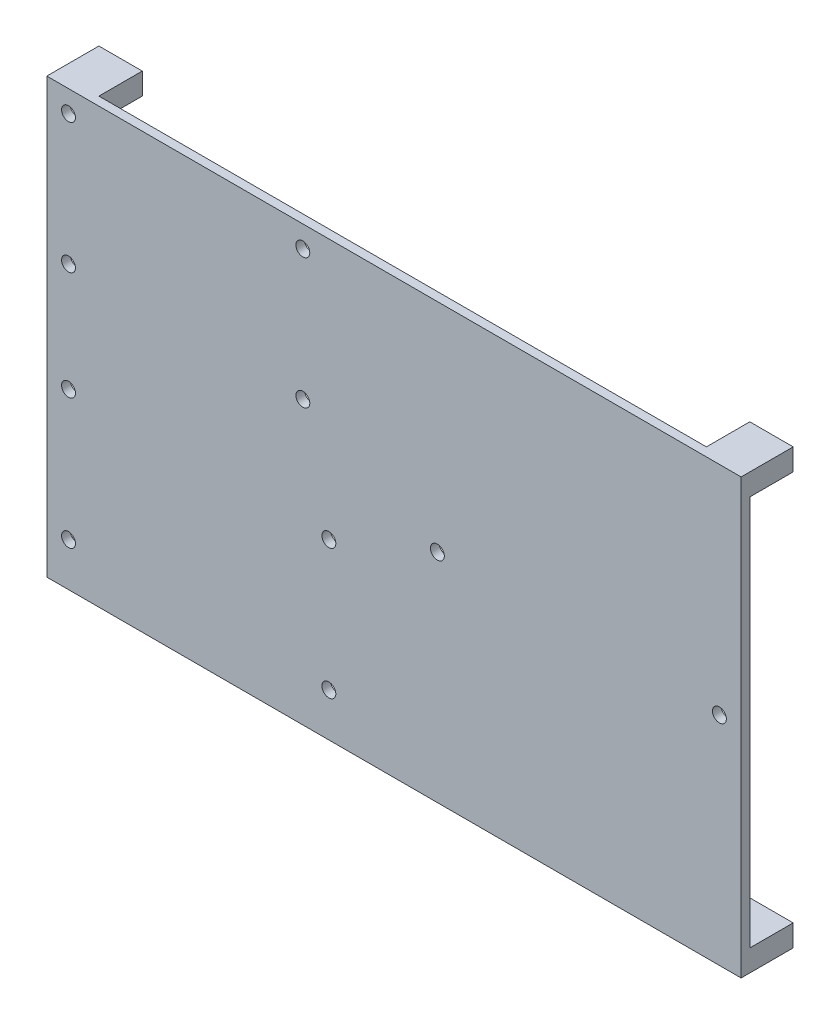
ISO-10303-21;
HEADER;
FILE_DESCRIPTION(('STEP AP214'),'2;1');
FILE_NAME('part.step','',(''),(''),'','','');
FILE_SCHEMA(('AUTOMOTIVE_DESIGN { 1 0 10303 214 1 1 1 1 }'));
ENDSEC;
DATA;
#1=APPLICATION_CONTEXT('core data for automotive mechanical design processes');
#2=APPLICATION_PROTOCOL_DEFINITION('international standard','automotive_design',2000,#1);
#3=PRODUCT_CONTEXT('',#1,'mechanical');
#4=PRODUCT('Part','Part','',(#3));
#5=PRODUCT_RELATED_PRODUCT_CATEGORY('part','',(#4));
#6=PRODUCT_DEFINITION_FORMATION('','',#4);
#7=PRODUCT_DEFINITION_CONTEXT('part definition',#1,'design');
#8=PRODUCT_DEFINITION('design','',#6,#7);
#9=PRODUCT_DEFINITION_SHAPE('','',#8);
#10=(LENGTH_UNIT() NAMED_UNIT(*) SI_UNIT(.MILLI.,.METRE.));
#11=(NAMED_UNIT(*) PLANE_ANGLE_UNIT() SI_UNIT($,.RADIAN.));
#12=(NAMED_UNIT(*) SI_UNIT($,.STERADIAN.) SOLID_ANGLE_UNIT());
#13=UNCERTAINTY_MEASURE_WITH_UNIT(LENGTH_MEASURE(1.E-05),#10,'distance_accuracy_value','');
#14=(GEOMETRIC_REPRESENTATION_CONTEXT(3) GLOBAL_UNCERTAINTY_ASSIGNED_CONTEXT((#13)) GLOBAL_UNIT_ASSIGNED_CONTEXT((#10,
#11,#12)) REPRESENTATION_CONTEXT('',''));
#15=CARTESIAN_POINT('',(0.,0.,0.));
#16=DIRECTION('',(0.,0.,1.));
#17=DIRECTION('',(1.,0.,0.));
#18=AXIS2_PLACEMENT_3D('',#15,#16,#17);
#19=CARTESIAN_POINT('',(0.,0.,2.));
#20=DIRECTION('',(0.,0.,1.));
#21=DIRECTION('',(1.,0.,0.));
#22=AXIS2_PLACEMENT_3D('',#19,#20,#21);
#23=PLANE('',#22);
#24=CARTESIAN_POINT('',(-1.53384445171995,11.8620860109576,2.));
#25=DIRECTION('',(0.,0.,1.));
#26=DIRECTION('',(1.,0.,0.));
#27=AXIS2_PLACEMENT_3D('',#24,#25,#26);
#28=CIRCLE('',#27,1.6);
#29=CARTESIAN_POINT('',(0.0661555482800562,11.8620860109576,2.));
#30=VERTEX_POINT('',#29);
#31=EDGE_CURVE('E291',#30,#30,#28,.T.);
#32=ORIENTED_EDGE('',*,*,#31,.F.);
#33=EDGE_LOOP('',(#32));
#34=FACE_BOUND('',#33,.T.);
#35=CARTESIAN_POINT('',(-55.53384445172,41.8620860109576,2.));
#36=DIRECTION('',(0.,0.,1.));
#37=DIRECTION('',(1.,0.,0.));
#38=AXIS2_PLACEMENT_3D('',#35,#36,#37);
#39=CIRCLE('',#38,1.6);
#40=CARTESIAN_POINT('',(-53.93384445172,41.8620860109576,2.));
#41=VERTEX_POINT('',#40);
#42=EDGE_CURVE('E307',#41,#41,#39,.T.);
#43=ORIENTED_EDGE('',*,*,#42,.F.);
#44=EDGE_LOOP('',(#43));
#45=FACE_BOUND('',#44,.T.);
#46=CARTESIAN_POINT('',(4.46615554828006,-13.1379139890424,2.));
#47=DIRECTION('',(0.,0.,1.));
#48=DIRECTION('',(1.,0.,0.));
#49=AXIS2_PLACEMENT_3D('',#46,#47,#48);
#50=CIRCLE('',#49,1.6);
#51=CARTESIAN_POINT('',(6.06615554828007,-13.1379139890424,2.));
#52=VERTEX_POINT('',#51);
#53=EDGE_CURVE('E323',#52,#52,#50,.T.);
#54=ORIENTED_EDGE('',*,*,#53,.F.);
#55=EDGE_LOOP('',(#54));
#56=FACE_BOUND('',#55,.T.);
#57=CARTESIAN_POINT('',(-55.5338444517199,-43.1379139890424,2.));
#58=DIRECTION('',(0.,0.,1.));
#59=DIRECTION('',(1.,0.,0.));
#60=AXIS2_PLACEMENT_3D('',#57,#58,#59);
#61=CIRCLE('',#60,1.6);
#62=CARTESIAN_POINT('',(-53.9338444517199,-43.1379139890424,2.));
#63=VERTEX_POINT('',#62);
#64=EDGE_CURVE('E339',#63,#63,#61,.T.);
#65=ORIENTED_EDGE('',*,*,#64,.F.);
#66=EDGE_LOOP('',(#65));
#67=FACE_BOUND('',#66,.T.);
#68=CARTESIAN_POINT('',(94.4661555482801,-3.1379139890424,2.));
#69=DIRECTION('',(0.,0.,1.));
#70=DIRECTION('',(1.,0.,0.));
#71=AXIS2_PLACEMENT_3D('',#68,#69,#70);
#72=CIRCLE('',#71,1.60000000000001);
#73=CARTESIAN_POINT('',(96.0661555482801,-3.1379139890424,2.));
#74=VERTEX_POINT('',#73);
#75=EDGE_CURVE('E355',#74,#74,#72,.T.);
#76=ORIENTED_EDGE('',*,*,#75,.F.);
#77=EDGE_LOOP('',(#76));
#78=FACE_BOUND('',#77,.T.);
#79=DIRECTION('',(0.,-1.,0.));
#80=VECTOR('',#79,1.);
#81=CARTESIAN_POINT('',(-60.5338444517199,46.8620860109576,2.));
#82=LINE('',#81,#80);
#83=CARTESIAN_POINT('',(-60.5338444517199,46.8620860109576,2.));
#84=VERTEX_POINT('',#83);
#85=CARTESIAN_POINT('',(-60.5338444517199,-53.1379139890424,2.));
#86=VERTEX_POINT('',#85);
#87=EDGE_CURVE('E196',#84,#86,#82,.T.);
#88=ORIENTED_EDGE('',*,*,#87,.T.);
#89=DIRECTION('',(1.,0.,0.));
#90=VECTOR('',#89,1.);
#91=CARTESIAN_POINT('',(-60.5338444517199,-53.1379139890424,2.));
#92=LINE('',#91,#90);
#93=CARTESIAN_POINT('',(99.4661555482801,-53.1379139890424,2.));
#94=VERTEX_POINT('',#93);
#95=EDGE_CURVE('E202',#86,#94,#92,.T.);
#96=ORIENTED_EDGE('',*,*,#95,.T.);
#97=DIRECTION('',(0.,1.,0.));
#98=VECTOR('',#97,1.);
#99=CARTESIAN_POINT('',(99.4661555482801,46.8620860109576,2.));
#100=LINE('',#99,#98);
#101=CARTESIAN_POINT('',(99.4661555482801,46.8620860109576,2.));
#102=VERTEX_POINT('',#101);
#103=EDGE_CURVE('E365',#94,#102,#100,.T.);
#104=ORIENTED_EDGE('',*,*,#103,.T.);
#105=DIRECTION('',(-1.,0.,0.));
#106=VECTOR('',#105,1.);
#107=CARTESIAN_POINT('',(-60.5338444517199,46.8620860109576,2.));
#108=LINE('',#107,#106);
#109=EDGE_CURVE('E213',#102,#84,#108,.T.);
#110=ORIENTED_EDGE('',*,*,#109,.T.);
#111=EDGE_LOOP('',(#88,#96,#104,#110));
#112=FACE_BOUND('',#111,.T.);
#113=CARTESIAN_POINT('',(29.4661555482801,-3.1379139890424,2.));
#114=DIRECTION('',(0.,0.,1.));
#115=DIRECTION('',(1.,0.,0.));
#116=AXIS2_PLACEMENT_3D('',#113,#114,#115);
#117=CIRCLE('',#116,1.6);
#118=CARTESIAN_POINT('',(31.0661555482801,-3.1379139890424,2.));
#119=VERTEX_POINT('',#118);
#120=EDGE_CURVE('E347',#119,#119,#117,.T.);
#121=ORIENTED_EDGE('',*,*,#120,.F.);
#122=EDGE_LOOP('',(#121));
#123=FACE_BOUND('',#122,.T.);
#124=CARTESIAN_POINT('',(-55.5338444517199,-13.1379139890424,2.));
#125=DIRECTION('',(0.,0.,1.));
#126=DIRECTION('',(1.,0.,0.));
#127=AXIS2_PLACEMENT_3D('',#124,#125,#126);
#128=CIRCLE('',#127,1.6);
#129=CARTESIAN_POINT('',(-53.9338444517199,-13.1379139890424,2.));
#130=VERTEX_POINT('',#129);
#131=EDGE_CURVE('E331',#130,#130,#128,.T.);
#132=ORIENTED_EDGE('',*,*,#131,.F.);
#133=EDGE_LOOP('',(#132));
#134=FACE_BOUND('',#133,.T.);
#135=CARTESIAN_POINT('',(4.46615554828008,-43.1379139890424,2.));
#136=DIRECTION('',(0.,0.,1.));
#137=DIRECTION('',(1.,0.,0.));
#138=AXIS2_PLACEMENT_3D('',#135,#136,#137);
#139=CIRCLE('',#138,1.6);
#140=CARTESIAN_POINT('',(6.06615554828007,-43.1379139890424,2.));
#141=VERTEX_POINT('',#140);
#142=EDGE_CURVE('E315',#141,#141,#139,.T.);
#143=ORIENTED_EDGE('',*,*,#142,.F.);
#144=EDGE_LOOP('',(#143));
#145=FACE_BOUND('',#144,.T.);
#146=CARTESIAN_POINT('',(-55.53384445172,11.8620860109576,2.));
#147=DIRECTION('',(0.,0.,1.));
#148=DIRECTION('',(1.,0.,0.));
#149=AXIS2_PLACEMENT_3D('',#146,#147,#148);
#150=CIRCLE('',#149,1.6);
#151=CARTESIAN_POINT('',(-53.93384445172,11.8620860109576,2.));
#152=VERTEX_POINT('',#151);
#153=EDGE_CURVE('E299',#152,#152,#150,.T.);
#154=ORIENTED_EDGE('',*,*,#153,.F.);
#155=EDGE_LOOP('',(#154));
#156=FACE_BOUND('',#155,.T.);
#157=CARTESIAN_POINT('',(-1.53384445171996,41.8620860109576,2.));
#158=DIRECTION('',(0.,0.,1.));
#159=DIRECTION('',(1.,0.,0.));
#160=AXIS2_PLACEMENT_3D('',#157,#158,#159);
#161=CIRCLE('',#160,1.6);
#162=CARTESIAN_POINT('',(0.0661555482800401,41.8620860109576,2.));
#163=VERTEX_POINT('',#162);
#164=EDGE_CURVE('E283',#163,#163,#161,.T.);
#165=ORIENTED_EDGE('',*,*,#164,.F.);
#166=EDGE_LOOP('',(#165));
#167=FACE_BOUND('',#166,.T.);
#168=ADVANCED_FACE('F45',(#34,#45,#56,#67,#78,#112,#123,#134,#145,#156,#167),#23,.T.);
#169=CARTESIAN_POINT('',(0.,0.,0.));
#170=DIRECTION('',(0.,0.,1.));
#171=DIRECTION('',(1.,0.,0.));
#172=AXIS2_PLACEMENT_3D('',#169,#170,#171);
#173=PLANE('',#172);
#174=CARTESIAN_POINT('',(94.4661555482801,-3.1379139890424,0.));
#175=DIRECTION('',(0.,0.,1.));
#176=DIRECTION('',(1.,0.,0.));
#177=AXIS2_PLACEMENT_3D('',#174,#175,#176);
#178=CIRCLE('',#177,1.60000000000001);
#179=CARTESIAN_POINT('',(96.0661555482801,-3.1379139890424,0.));
#180=VERTEX_POINT('',#179);
#181=EDGE_CURVE('E351',#180,#180,#178,.T.);
#182=ORIENTED_EDGE('',*,*,#181,.T.);
#183=EDGE_LOOP('',(#182));
#184=FACE_BOUND('',#183,.T.);
#185=CARTESIAN_POINT('',(29.4661555482801,-3.1379139890424,0.));
#186=DIRECTION('',(0.,0.,1.));
#187=DIRECTION('',(1.,0.,0.));
#188=AXIS2_PLACEMENT_3D('',#185,#186,#187);
#189=CIRCLE('',#188,1.6);
#190=CARTESIAN_POINT('',(31.0661555482801,-3.1379139890424,0.));
#191=VERTEX_POINT('',#190);
#192=EDGE_CURVE('E343',#191,#191,#189,.T.);
#193=ORIENTED_EDGE('',*,*,#192,.T.);
#194=EDGE_LOOP('',(#193));
#195=FACE_BOUND('',#194,.T.);
#196=CARTESIAN_POINT('',(-55.5338444517199,-43.1379139890424,0.));
#197=DIRECTION('',(0.,0.,1.));
#198=DIRECTION('',(1.,0.,0.));
#199=AXIS2_PLACEMENT_3D('',#196,#197,#198);
#200=CIRCLE('',#199,1.6);
#201=CARTESIAN_POINT('',(-53.9338444517199,-43.1379139890424,0.));
#202=VERTEX_POINT('',#201);
#203=EDGE_CURVE('E335',#202,#202,#200,.T.);
#204=ORIENTED_EDGE('',*,*,#203,.T.);
#205=EDGE_LOOP('',(#204));
#206=FACE_BOUND('',#205,.T.);
#207=CARTESIAN_POINT('',(-55.5338444517199,-13.1379139890424,0.));
#208=DIRECTION('',(0.,0.,1.));
#209=DIRECTION('',(1.,0.,0.));
#210=AXIS2_PLACEMENT_3D('',#207,#208,#209);
#211=CIRCLE('',#210,1.6);
#212=CARTESIAN_POINT('',(-53.9338444517199,-13.1379139890424,0.));
#213=VERTEX_POINT('',#212);
#214=EDGE_CURVE('E327',#213,#213,#211,.T.);
#215=ORIENTED_EDGE('',*,*,#214,.T.);
#216=EDGE_LOOP('',(#215));
#217=FACE_BOUND('',#216,.T.);
#218=CARTESIAN_POINT('',(4.46615554828006,-13.1379139890424,0.));
#219=DIRECTION('',(0.,0.,1.));
#220=DIRECTION('',(1.,0.,0.));
#221=AXIS2_PLACEMENT_3D('',#218,#219,#220);
#222=CIRCLE('',#221,1.6);
#223=CARTESIAN_POINT('',(6.06615554828007,-13.1379139890424,0.));
#224=VERTEX_POINT('',#223);
#225=EDGE_CURVE('E319',#224,#224,#222,.T.);
#226=ORIENTED_EDGE('',*,*,#225,.T.);
#227=EDGE_LOOP('',(#226));
#228=FACE_BOUND('',#227,.T.);
#229=CARTESIAN_POINT('',(4.46615554828008,-43.1379139890424,0.));
#230=DIRECTION('',(0.,0.,1.));
#231=DIRECTION('',(1.,0.,0.));
#232=AXIS2_PLACEMENT_3D('',#229,#230,#231);
#233=CIRCLE('',#232,1.6);
#234=CARTESIAN_POINT('',(6.06615554828007,-43.1379139890424,0.));
#235=VERTEX_POINT('',#234);
#236=EDGE_CURVE('E311',#235,#235,#233,.T.);
#237=ORIENTED_EDGE('',*,*,#236,.T.);
#238=EDGE_LOOP('',(#237));
#239=FACE_BOUND('',#238,.T.);
#240=DIRECTION('',(0.,1.,0.));
#241=VECTOR('',#240,1.);
#242=CARTESIAN_POINT('',(-50.5338444517199,0.,0.));
#243=LINE('',#242,#241);
#244=CARTESIAN_POINT('',(-50.5338444517199,-53.1379139890424,0.));
#245=VERTEX_POINT('',#244);
#246=CARTESIAN_POINT('',(-50.5338444517199,-48.1379139890424,0.));
#247=VERTEX_POINT('',#246);
#248=EDGE_CURVE('E249',#245,#247,#243,.T.);
#249=ORIENTED_EDGE('',*,*,#248,.T.);
#250=DIRECTION('',(-1.,0.,0.));
#251=VECTOR('',#250,1.);
#252=CARTESIAN_POINT('',(0.,-48.1379139890424,0.));
#253=LINE('',#252,#251);
#254=CARTESIAN_POINT('',(-60.5338444517199,-48.1379139890424,0.));
#255=VERTEX_POINT('',#254);
#256=EDGE_CURVE('E64',#247,#255,#253,.T.);
#257=ORIENTED_EDGE('',*,*,#256,.T.);
#258=DIRECTION('',(0.,-1.,0.));
#259=VECTOR('',#258,1.);
#260=CARTESIAN_POINT('',(-60.5338444517199,46.8620860109576,0.));
#261=LINE('',#260,#259);
#262=CARTESIAN_POINT('',(-60.5338444517199,41.8620860109576,0.));
#263=VERTEX_POINT('',#262);
#264=EDGE_CURVE('E359',#263,#255,#261,.T.);
#265=ORIENTED_EDGE('',*,*,#264,.F.);
#266=DIRECTION('',(1.,0.,0.));
#267=VECTOR('',#266,1.);
#268=CARTESIAN_POINT('',(0.,41.8620860109576,0.));
#269=LINE('',#268,#267);
#270=CARTESIAN_POINT('',(-57.13384445172,41.8620860109576,0.));
#271=VERTEX_POINT('',#270);
#272=EDGE_CURVE('E56',#263,#271,#269,.T.);
#273=ORIENTED_EDGE('',*,*,#272,.T.);
#274=CARTESIAN_POINT('',(-55.53384445172,41.8620860109576,0.));
#275=DIRECTION('',(0.,0.,1.));
#276=DIRECTION('',(1.,0.,0.));
#277=AXIS2_PLACEMENT_3D('',#274,#275,#276);
#278=CIRCLE('',#277,1.6);
#279=CARTESIAN_POINT('',(-53.93384445172,41.8620860109576,0.));
#280=VERTEX_POINT('',#279);
#281=EDGE_CURVE('E303',#271,#280,#278,.T.);
#282=ORIENTED_EDGE('',*,*,#281,.T.);
#283=CARTESIAN_POINT('',(-50.5338444517199,41.8620860109576,0.));
#284=VERTEX_POINT('',#283);
#285=EDGE_CURVE('E11',#280,#284,#269,.T.);
#286=ORIENTED_EDGE('',*,*,#285,.T.);
#287=DIRECTION('',(0.,1.,0.));
#288=VECTOR('',#287,1.);
#289=CARTESIAN_POINT('',(-50.5338444517199,0.,0.));
#290=LINE('',#289,#288);
#291=CARTESIAN_POINT('',(-50.5338444517199,46.8620860109576,0.));
#292=VERTEX_POINT('',#291);
#293=EDGE_CURVE('E194',#284,#292,#290,.T.);
#294=ORIENTED_EDGE('',*,*,#293,.T.);
#295=DIRECTION('',(-1.,0.,0.));
#296=VECTOR('',#295,1.);
#297=CARTESIAN_POINT('',(-60.5338444517199,46.8620860109576,0.));
#298=LINE('',#297,#296);
#299=CARTESIAN_POINT('',(89.4661555482801,46.8620860109576,0.));
#300=VERTEX_POINT('',#299);
#301=EDGE_CURVE('E172',#300,#292,#298,.T.);
#302=ORIENTED_EDGE('',*,*,#301,.F.);
#303=DIRECTION('',(0.,-1.,0.));
#304=VECTOR('',#303,1.);
#305=CARTESIAN_POINT('',(89.4661555482801,0.,0.));
#306=LINE('',#305,#304);
#307=CARTESIAN_POINT('',(89.4661555482801,41.8620860109576,0.));
#308=VERTEX_POINT('',#307);
#309=EDGE_CURVE('E183',#300,#308,#306,.T.);
#310=ORIENTED_EDGE('',*,*,#309,.T.);
#311=DIRECTION('',(1.,0.,0.));
#312=VECTOR('',#311,1.);
#313=CARTESIAN_POINT('',(0.,41.8620860109575,0.));
#314=LINE('',#313,#312);
#315=CARTESIAN_POINT('',(99.4661555482801,41.8620860109576,0.));
#316=VERTEX_POINT('',#315);
#317=EDGE_CURVE('E72',#308,#316,#314,.T.);
#318=ORIENTED_EDGE('',*,*,#317,.T.);
#319=DIRECTION('',(0.,1.,0.));
#320=VECTOR('',#319,1.);
#321=CARTESIAN_POINT('',(99.4661555482801,46.8620860109576,0.));
#322=LINE('',#321,#320);
#323=CARTESIAN_POINT('',(99.4661555482801,-48.1379139890424,0.));
#324=VERTEX_POINT('',#323);
#325=EDGE_CURVE('E197',#324,#316,#322,.T.);
#326=ORIENTED_EDGE('',*,*,#325,.F.);
#327=DIRECTION('',(-1.,0.,0.));
#328=VECTOR('',#327,1.);
#329=CARTESIAN_POINT('',(0.,-48.1379139890423,0.));
#330=LINE('',#329,#328);
#331=CARTESIAN_POINT('',(89.4661555482801,-48.1379139890424,0.));
#332=VERTEX_POINT('',#331);
#333=EDGE_CURVE('E385',#324,#332,#330,.T.);
#334=ORIENTED_EDGE('',*,*,#333,.T.);
#335=DIRECTION('',(0.,-1.,0.));
#336=VECTOR('',#335,1.);
#337=CARTESIAN_POINT('',(89.4661555482801,0.,0.));
#338=LINE('',#337,#336);
#339=CARTESIAN_POINT('',(89.4661555482801,-53.1379139890424,0.));
#340=VERTEX_POINT('',#339);
#341=EDGE_CURVE('E382',#332,#340,#338,.T.);
#342=ORIENTED_EDGE('',*,*,#341,.T.);
#343=DIRECTION('',(1.,0.,0.));
#344=VECTOR('',#343,1.);
#345=CARTESIAN_POINT('',(-60.5338444517199,-53.1379139890424,0.));
#346=LINE('',#345,#344);
#347=EDGE_CURVE('E205',#245,#340,#346,.T.);
#348=ORIENTED_EDGE('',*,*,#347,.F.);
#349=EDGE_LOOP('',(#249,#257,#265,#273,#282,#286,#294,#302,#310,#318,#326,#334,#342,#348));
#350=FACE_BOUND('',#349,.T.);
#351=CARTESIAN_POINT('',(-55.53384445172,11.8620860109576,0.));
#352=DIRECTION('',(0.,0.,1.));
#353=DIRECTION('',(1.,0.,0.));
#354=AXIS2_PLACEMENT_3D('',#351,#352,#353);
#355=CIRCLE('',#354,1.6);
#356=CARTESIAN_POINT('',(-53.93384445172,11.8620860109576,0.));
#357=VERTEX_POINT('',#356);
#358=EDGE_CURVE('E295',#357,#357,#355,.T.);
#359=ORIENTED_EDGE('',*,*,#358,.T.);
#360=EDGE_LOOP('',(#359));
#361=FACE_BOUND('',#360,.T.);
#362=CARTESIAN_POINT('',(-1.53384445171995,11.8620860109576,0.));
#363=DIRECTION('',(0.,0.,1.));
#364=DIRECTION('',(1.,0.,0.));
#365=AXIS2_PLACEMENT_3D('',#362,#363,#364);
#366=CIRCLE('',#365,1.6);
#367=CARTESIAN_POINT('',(0.0661555482800562,11.8620860109576,0.));
#368=VERTEX_POINT('',#367);
#369=EDGE_CURVE('E287',#368,#368,#366,.T.);
#370=ORIENTED_EDGE('',*,*,#369,.T.);
#371=EDGE_LOOP('',(#370));
#372=FACE_BOUND('',#371,.T.);
#373=CARTESIAN_POINT('',(-1.53384445171996,41.8620860109576,0.));
#374=DIRECTION('',(0.,0.,1.));
#375=DIRECTION('',(1.,0.,0.));
#376=AXIS2_PLACEMENT_3D('',#373,#374,#375);
#377=CIRCLE('',#376,1.6);
#378=CARTESIAN_POINT('',(0.0661555482800401,41.8620860109576,0.));
#379=VERTEX_POINT('',#378);
#380=EDGE_CURVE('E277',#379,#379,#377,.T.);
#381=ORIENTED_EDGE('',*,*,#380,.T.);
#382=EDGE_LOOP('',(#381));
#383=FACE_BOUND('',#382,.T.);
#384=ADVANCED_FACE('F191',(#184,#195,#206,#217,#228,#239,#350,#361,#372,#383),#173,.F.);
#385=CARTESIAN_POINT('',(-60.5338444517199,46.8620860109576,2.));
#386=DIRECTION('',(1.,0.,0.));
#387=DIRECTION('',(0.,1.,0.));
#388=AXIS2_PLACEMENT_3D('',#385,#386,#387);
#389=PLANE('',#388);
#390=DIRECTION('',(0.,0.,-1.));
#391=VECTOR('',#390,1.);
#392=CARTESIAN_POINT('',(-60.5338444517199,46.8620860109576,2.));
#393=LINE('',#392,#391);
#394=CARTESIAN_POINT('',(-60.5338444517199,46.8620860109576,-10.));
#395=VERTEX_POINT('',#394);
#396=EDGE_CURVE('E209',#84,#395,#393,.T.);
#397=ORIENTED_EDGE('',*,*,#396,.T.);
#398=DIRECTION('',(0.,-1.,0.));
#399=VECTOR('',#398,1.);
#400=CARTESIAN_POINT('',(-60.5338444517199,0.,-10.));
#401=LINE('',#400,#399);
#402=CARTESIAN_POINT('',(-60.5338444517199,41.8620860109576,-10.));
#403=VERTEX_POINT('',#402);
#404=EDGE_CURVE('E257',#395,#403,#401,.T.);
#405=ORIENTED_EDGE('',*,*,#404,.T.);
#406=DIRECTION('',(0.,0.,1.));
#407=VECTOR('',#406,1.);
#408=CARTESIAN_POINT('',(-60.5338444517199,41.8620860109576,-10.));
#409=LINE('',#408,#407);
#410=EDGE_CURVE('E268',#403,#263,#409,.T.);
#411=ORIENTED_EDGE('',*,*,#410,.T.);
#412=ORIENTED_EDGE('',*,*,#264,.T.);
#413=DIRECTION('',(0.,0.,1.));
#414=VECTOR('',#413,1.);
#415=CARTESIAN_POINT('',(-60.5338444517199,-48.1379139890424,-10.));
#416=LINE('',#415,#414);
#417=CARTESIAN_POINT('',(-60.5338444517199,-48.1379139890424,-10.));
#418=VERTEX_POINT('',#417);
#419=EDGE_CURVE('E244',#418,#255,#416,.T.);
#420=ORIENTED_EDGE('',*,*,#419,.F.);
#421=DIRECTION('',(0.,-1.,0.));
#422=VECTOR('',#421,1.);
#423=CARTESIAN_POINT('',(-60.5338444517199,0.,-10.));
#424=LINE('',#423,#422);
#425=CARTESIAN_POINT('',(-60.5338444517199,-53.1379139890424,-10.));
#426=VERTEX_POINT('',#425);
#427=EDGE_CURVE('E237',#418,#426,#424,.T.);
#428=ORIENTED_EDGE('',*,*,#427,.T.);
#429=DIRECTION('',(0.,0.,-1.));
#430=VECTOR('',#429,1.);
#431=CARTESIAN_POINT('',(-60.5338444517199,-53.1379139890424,2.));
#432=LINE('',#431,#430);
#433=EDGE_CURVE('E49',#86,#426,#432,.T.);
#434=ORIENTED_EDGE('',*,*,#433,.F.);
#435=ORIENTED_EDGE('',*,*,#87,.F.);
#436=EDGE_LOOP('',(#397,#405,#411,#412,#420,#428,#434,#435));
#437=FACE_BOUND('',#436,.T.);
#438=ADVANCED_FACE('F47',(#437),#389,.F.);
#439=CARTESIAN_POINT('',(-60.5338444517199,-53.1379139890424,2.));
#440=DIRECTION('',(0.,1.,0.));
#441=DIRECTION('',(0.,0.,1.));
#442=AXIS2_PLACEMENT_3D('',#439,#440,#441);
#443=PLANE('',#442);
#444=ORIENTED_EDGE('',*,*,#433,.T.);
#445=DIRECTION('',(1.,0.,0.));
#446=VECTOR('',#445,1.);
#447=CARTESIAN_POINT('',(0.,-53.1379139890424,-10.));
#448=LINE('',#447,#446);
#449=CARTESIAN_POINT('',(-50.5338444517199,-53.1379139890424,-10.));
#450=VERTEX_POINT('',#449);
#451=EDGE_CURVE('E228',#426,#450,#448,.T.);
#452=ORIENTED_EDGE('',*,*,#451,.T.);
#453=DIRECTION('',(0.,0.,1.));
#454=VECTOR('',#453,1.);
#455=CARTESIAN_POINT('',(-50.5338444517199,-53.1379139890424,-10.));
#456=LINE('',#455,#454);
#457=EDGE_CURVE('E377',#450,#245,#456,.T.);
#458=ORIENTED_EDGE('',*,*,#457,.T.);
#459=ORIENTED_EDGE('',*,*,#347,.T.);
#460=DIRECTION('',(0.,0.,1.));
#461=VECTOR('',#460,1.);
#462=CARTESIAN_POINT('',(89.4661555482801,-53.1379139890424,-10.));
#463=LINE('',#462,#461);
#464=CARTESIAN_POINT('',(89.4661555482801,-53.1379139890424,-10.));
#465=VERTEX_POINT('',#464);
#466=EDGE_CURVE('E375',#465,#340,#463,.T.);
#467=ORIENTED_EDGE('',*,*,#466,.F.);
#468=DIRECTION('',(1.,0.,0.));
#469=VECTOR('',#468,1.);
#470=CARTESIAN_POINT('',(0.,-53.1379139890424,-10.));
#471=LINE('',#470,#469);
#472=CARTESIAN_POINT('',(99.4661555482801,-53.1379139890424,-10.));
#473=VERTEX_POINT('',#472);
#474=EDGE_CURVE('E388',#465,#473,#471,.T.);
#475=ORIENTED_EDGE('',*,*,#474,.T.);
#476=DIRECTION('',(0.,0.,-1.));
#477=VECTOR('',#476,1.);
#478=CARTESIAN_POINT('',(99.4661555482801,-53.1379139890424,2.));
#479=LINE('',#478,#477);
#480=EDGE_CURVE('E215',#94,#473,#479,.T.);
#481=ORIENTED_EDGE('',*,*,#480,.F.);
#482=ORIENTED_EDGE('',*,*,#95,.F.);
#483=EDGE_LOOP('',(#444,#452,#458,#459,#467,#475,#481,#482));
#484=FACE_BOUND('',#483,.T.);
#485=ADVANCED_FACE('F227',(#484),#443,.F.);
#486=CARTESIAN_POINT('',(99.4661555482801,46.8620860109576,2.));
#487=DIRECTION('',(-1.,0.,0.));
#488=DIRECTION('',(0.,0.,1.));
#489=AXIS2_PLACEMENT_3D('',#486,#487,#488);
#490=PLANE('',#489);
#491=ORIENTED_EDGE('',*,*,#480,.T.);
#492=DIRECTION('',(0.,1.,0.));
#493=VECTOR('',#492,1.);
#494=CARTESIAN_POINT('',(99.4661555482801,0.,-10.));
#495=LINE('',#494,#493);
#496=CARTESIAN_POINT('',(99.4661555482801,-48.1379139890424,-10.));
#497=VERTEX_POINT('',#496);
#498=EDGE_CURVE('E393',#473,#497,#495,.T.);
#499=ORIENTED_EDGE('',*,*,#498,.T.);
#500=DIRECTION('',(0.,0.,1.));
#501=VECTOR('',#500,1.);
#502=CARTESIAN_POINT('',(99.4661555482801,-48.1379139890424,-10.));
#503=LINE('',#502,#501);
#504=EDGE_CURVE('E403',#497,#324,#503,.T.);
#505=ORIENTED_EDGE('',*,*,#504,.T.);
#506=ORIENTED_EDGE('',*,*,#325,.T.);
#507=DIRECTION('',(0.,0.,1.));
#508=VECTOR('',#507,1.);
#509=CARTESIAN_POINT('',(99.4661555482801,41.8620860109576,-10.));
#510=LINE('',#509,#508);
#511=CARTESIAN_POINT('',(99.4661555482801,41.8620860109576,-10.));
#512=VERTEX_POINT('',#511);
#513=EDGE_CURVE('E179',#512,#316,#510,.T.);
#514=ORIENTED_EDGE('',*,*,#513,.F.);
#515=DIRECTION('',(0.,1.,0.));
#516=VECTOR('',#515,1.);
#517=CARTESIAN_POINT('',(99.4661555482801,0.,-10.));
#518=LINE('',#517,#516);
#519=CARTESIAN_POINT('',(99.4661555482801,46.8620860109576,-10.));
#520=VERTEX_POINT('',#519);
#521=EDGE_CURVE('E443',#512,#520,#518,.T.);
#522=ORIENTED_EDGE('',*,*,#521,.T.);
#523=DIRECTION('',(0.,0.,-1.));
#524=VECTOR('',#523,1.);
#525=CARTESIAN_POINT('',(99.4661555482801,46.8620860109576,2.));
#526=LINE('',#525,#524);
#527=EDGE_CURVE('E212',#102,#520,#526,.T.);
#528=ORIENTED_EDGE('',*,*,#527,.F.);
#529=ORIENTED_EDGE('',*,*,#103,.F.);
#530=EDGE_LOOP('',(#491,#499,#505,#506,#514,#522,#528,#529));
#531=FACE_BOUND('',#530,.T.);
#532=ADVANCED_FACE('F468',(#531),#490,.F.);
#533=CARTESIAN_POINT('',(-60.5338444517199,46.8620860109576,2.));
#534=DIRECTION('',(0.,-1.,0.));
#535=DIRECTION('',(1.,0.,0.));
#536=AXIS2_PLACEMENT_3D('',#533,#534,#535);
#537=PLANE('',#536);
#538=ORIENTED_EDGE('',*,*,#527,.T.);
#539=DIRECTION('',(-1.,0.,0.));
#540=VECTOR('',#539,1.);
#541=CARTESIAN_POINT('',(0.,46.8620860109576,-10.));
#542=LINE('',#541,#540);
#543=CARTESIAN_POINT('',(89.4661555482801,46.8620860109576,-10.));
#544=VERTEX_POINT('',#543);
#545=EDGE_CURVE('E174',#520,#544,#542,.T.);
#546=ORIENTED_EDGE('',*,*,#545,.T.);
#547=DIRECTION('',(0.,0.,1.));
#548=VECTOR('',#547,1.);
#549=CARTESIAN_POINT('',(89.4661555482801,46.8620860109576,-10.));
#550=LINE('',#549,#548);
#551=EDGE_CURVE('E168',#544,#300,#550,.T.);
#552=ORIENTED_EDGE('',*,*,#551,.T.);
#553=ORIENTED_EDGE('',*,*,#301,.T.);
#554=DIRECTION('',(0.,0.,1.));
#555=VECTOR('',#554,1.);
#556=CARTESIAN_POINT('',(-50.5338444517199,46.8620860109576,-10.));
#557=LINE('',#556,#555);
#558=CARTESIAN_POINT('',(-50.5338444517199,46.8620860109576,-10.));
#559=VERTEX_POINT('',#558);
#560=EDGE_CURVE('E274',#559,#292,#557,.T.);
#561=ORIENTED_EDGE('',*,*,#560,.F.);
#562=DIRECTION('',(-1.,0.,0.));
#563=VECTOR('',#562,1.);
#564=CARTESIAN_POINT('',(0.,46.8620860109576,-10.));
#565=LINE('',#564,#563);
#566=EDGE_CURVE('E253',#559,#395,#565,.T.);
#567=ORIENTED_EDGE('',*,*,#566,.T.);
#568=ORIENTED_EDGE('',*,*,#396,.F.);
#569=ORIENTED_EDGE('',*,*,#109,.F.);
#570=EDGE_LOOP('',(#538,#546,#552,#553,#561,#567,#568,#569));
#571=FACE_BOUND('',#570,.T.);
#572=ADVANCED_FACE('F170',(#571),#537,.F.);
#573=CARTESIAN_POINT('',(94.4661555482801,-3.1379139890424,2.));
#574=DIRECTION('',(0.,0.,-1.));
#575=DIRECTION('',(-1.,0.,0.));
#576=AXIS2_PLACEMENT_3D('',#573,#574,#575);
#577=CYLINDRICAL_SURFACE('',#576,1.60000000000001);
#578=ORIENTED_EDGE('',*,*,#75,.T.);
#579=EDGE_LOOP('',(#578));
#580=FACE_BOUND('',#579,.T.);
#581=ORIENTED_EDGE('',*,*,#181,.F.);
#582=EDGE_LOOP('',(#581));
#583=FACE_BOUND('',#582,.T.);
#584=ADVANCED_FACE('F503',(#580,#583),#577,.F.);
#585=CARTESIAN_POINT('',(29.4661555482801,-3.1379139890424,2.));
#586=DIRECTION('',(0.,0.,-1.));
#587=DIRECTION('',(-1.,0.,0.));
#588=AXIS2_PLACEMENT_3D('',#585,#586,#587);
#589=CYLINDRICAL_SURFACE('',#588,1.6);
#590=ORIENTED_EDGE('',*,*,#120,.T.);
#591=EDGE_LOOP('',(#590));
#592=FACE_BOUND('',#591,.T.);
#593=ORIENTED_EDGE('',*,*,#192,.F.);
#594=EDGE_LOOP('',(#593));
#595=FACE_BOUND('',#594,.T.);
#596=ADVANCED_FACE('F585',(#592,#595),#589,.F.);
#597=CARTESIAN_POINT('',(-55.5338444517199,-43.1379139890424,2.));
#598=DIRECTION('',(0.,0.,-1.));
#599=DIRECTION('',(-1.,0.,0.));
#600=AXIS2_PLACEMENT_3D('',#597,#598,#599);
#601=CYLINDRICAL_SURFACE('',#600,1.6);
#602=ORIENTED_EDGE('',*,*,#64,.T.);
#603=EDGE_LOOP('',(#602));
#604=FACE_BOUND('',#603,.T.);
#605=ORIENTED_EDGE('',*,*,#203,.F.);
#606=EDGE_LOOP('',(#605));
#607=FACE_BOUND('',#606,.T.);
#608=ADVANCED_FACE('F576',(#604,#607),#601,.F.);
#609=CARTESIAN_POINT('',(-55.5338444517199,-13.1379139890424,2.));
#610=DIRECTION('',(0.,0.,-1.));
#611=DIRECTION('',(-1.,0.,0.));
#612=AXIS2_PLACEMENT_3D('',#609,#610,#611);
#613=CYLINDRICAL_SURFACE('',#612,1.6);
#614=ORIENTED_EDGE('',*,*,#131,.T.);
#615=EDGE_LOOP('',(#614));
#616=FACE_BOUND('',#615,.T.);
#617=ORIENTED_EDGE('',*,*,#214,.F.);
#618=EDGE_LOOP('',(#617));
#619=FACE_BOUND('',#618,.T.);
#620=ADVANCED_FACE('F567',(#616,#619),#613,.F.);
#621=CARTESIAN_POINT('',(4.46615554828006,-13.1379139890424,2.));
#622=DIRECTION('',(0.,0.,-1.));
#623=DIRECTION('',(-1.,0.,0.));
#624=AXIS2_PLACEMENT_3D('',#621,#622,#623);
#625=CYLINDRICAL_SURFACE('',#624,1.6);
#626=ORIENTED_EDGE('',*,*,#53,.T.);
#627=EDGE_LOOP('',(#626));
#628=FACE_BOUND('',#627,.T.);
#629=ORIENTED_EDGE('',*,*,#225,.F.);
#630=EDGE_LOOP('',(#629));
#631=FACE_BOUND('',#630,.T.);
#632=ADVANCED_FACE('F558',(#628,#631),#625,.F.);
#633=CARTESIAN_POINT('',(4.46615554828008,-43.1379139890424,2.));
#634=DIRECTION('',(0.,0.,-1.));
#635=DIRECTION('',(-1.,0.,0.));
#636=AXIS2_PLACEMENT_3D('',#633,#634,#635);
#637=CYLINDRICAL_SURFACE('',#636,1.6);
#638=ORIENTED_EDGE('',*,*,#142,.T.);
#639=EDGE_LOOP('',(#638));
#640=FACE_BOUND('',#639,.T.);
#641=ORIENTED_EDGE('',*,*,#236,.F.);
#642=EDGE_LOOP('',(#641));
#643=FACE_BOUND('',#642,.T.);
#644=ADVANCED_FACE('F554',(#640,#643),#637,.F.);
#645=CARTESIAN_POINT('',(-55.53384445172,41.8620860109576,2.));
#646=DIRECTION('',(0.,0.,-1.));
#647=DIRECTION('',(-1.,0.,0.));
#648=AXIS2_PLACEMENT_3D('',#645,#646,#647);
#649=CYLINDRICAL_SURFACE('',#648,1.6);
#650=ORIENTED_EDGE('',*,*,#42,.T.);
#651=EDGE_LOOP('',(#650));
#652=FACE_BOUND('',#651,.T.);
#653=EDGE_CURVE('E312',#280,#271,#278,.T.);
#654=ORIENTED_EDGE('',*,*,#653,.F.);
#655=ORIENTED_EDGE('',*,*,#281,.F.);
#656=EDGE_LOOP('',(#654,#655));
#657=FACE_BOUND('',#656,.T.);
#658=ADVANCED_FACE('F435',(#652,#657),#649,.F.);
#659=CARTESIAN_POINT('',(-55.53384445172,11.8620860109576,2.));
#660=DIRECTION('',(0.,0.,-1.));
#661=DIRECTION('',(-1.,0.,0.));
#662=AXIS2_PLACEMENT_3D('',#659,#660,#661);
#663=CYLINDRICAL_SURFACE('',#662,1.6);
#664=ORIENTED_EDGE('',*,*,#153,.T.);
#665=EDGE_LOOP('',(#664));
#666=FACE_BOUND('',#665,.T.);
#667=ORIENTED_EDGE('',*,*,#358,.F.);
#668=EDGE_LOOP('',(#667));
#669=FACE_BOUND('',#668,.T.);
#670=ADVANCED_FACE('F539',(#666,#669),#663,.F.);
#671=CARTESIAN_POINT('',(-1.53384445171995,11.8620860109576,2.));
#672=DIRECTION('',(0.,0.,-1.));
#673=DIRECTION('',(-1.,0.,0.));
#674=AXIS2_PLACEMENT_3D('',#671,#672,#673);
#675=CYLINDRICAL_SURFACE('',#674,1.6);
#676=ORIENTED_EDGE('',*,*,#31,.T.);
#677=EDGE_LOOP('',(#676));
#678=FACE_BOUND('',#677,.T.);
#679=ORIENTED_EDGE('',*,*,#369,.F.);
#680=EDGE_LOOP('',(#679));
#681=FACE_BOUND('',#680,.T.);
#682=ADVANCED_FACE('F530',(#678,#681),#675,.F.);
#683=CARTESIAN_POINT('',(-1.53384445171996,41.8620860109576,2.));
#684=DIRECTION('',(0.,0.,-1.));
#685=DIRECTION('',(-1.,0.,0.));
#686=AXIS2_PLACEMENT_3D('',#683,#684,#685);
#687=CYLINDRICAL_SURFACE('',#686,1.6);
#688=ORIENTED_EDGE('',*,*,#164,.T.);
#689=EDGE_LOOP('',(#688));
#690=FACE_BOUND('',#689,.T.);
#691=ORIENTED_EDGE('',*,*,#380,.F.);
#692=EDGE_LOOP('',(#691));
#693=FACE_BOUND('',#692,.T.);
#694=ADVANCED_FACE('F526',(#690,#693),#687,.F.);
#695=CARTESIAN_POINT('',(-50.5338444517199,0.,-10.));
#696=DIRECTION('',(1.,0.,0.));
#697=DIRECTION('',(0.,0.,-1.));
#698=AXIS2_PLACEMENT_3D('',#695,#696,#697);
#699=PLANE('',#698);
#700=ORIENTED_EDGE('',*,*,#293,.F.);
#701=DIRECTION('',(0.,0.,1.));
#702=VECTOR('',#701,1.);
#703=CARTESIAN_POINT('',(-50.5338444517199,41.8620860109576,-10.));
#704=LINE('',#703,#702);
#705=CARTESIAN_POINT('',(-50.5338444517199,41.8620860109576,-10.));
#706=VERTEX_POINT('',#705);
#707=EDGE_CURVE('E278',#706,#284,#704,.T.);
#708=ORIENTED_EDGE('',*,*,#707,.F.);
#709=DIRECTION('',(0.,1.,0.));
#710=VECTOR('',#709,1.);
#711=CARTESIAN_POINT('',(-50.5338444517199,0.,-10.));
#712=LINE('',#711,#710);
#713=EDGE_CURVE('E265',#706,#559,#712,.T.);
#714=ORIENTED_EDGE('',*,*,#713,.T.);
#715=ORIENTED_EDGE('',*,*,#560,.T.);
#716=EDGE_LOOP('',(#700,#708,#714,#715));
#717=FACE_BOUND('',#716,.T.);
#718=ADVANCED_FACE('F478',(#717),#699,.T.);
#719=CARTESIAN_POINT('',(0.,41.8620860109576,-10.));
#720=DIRECTION('',(0.,-1.,0.));
#721=DIRECTION('',(0.,0.,-1.));
#722=AXIS2_PLACEMENT_3D('',#719,#720,#721);
#723=PLANE('',#722);
#724=ORIENTED_EDGE('',*,*,#272,.F.);
#725=ORIENTED_EDGE('',*,*,#410,.F.);
#726=DIRECTION('',(1.,0.,0.));
#727=VECTOR('',#726,1.);
#728=CARTESIAN_POINT('',(0.,41.8620860109576,-10.));
#729=LINE('',#728,#727);
#730=EDGE_CURVE('E261',#403,#706,#729,.T.);
#731=ORIENTED_EDGE('',*,*,#730,.T.);
#732=ORIENTED_EDGE('',*,*,#707,.T.);
#733=ORIENTED_EDGE('',*,*,#285,.F.);
#734=EDGE_CURVE('E57',#271,#280,#269,.T.);
#735=ORIENTED_EDGE('',*,*,#734,.F.);
#736=EDGE_LOOP('',(#724,#725,#731,#732,#733,#735));
#737=FACE_BOUND('',#736,.T.);
#738=ADVANCED_FACE('F429',(#737),#723,.T.);
#739=CARTESIAN_POINT('',(0.,0.,-10.));
#740=DIRECTION('',(0.,0.,1.));
#741=DIRECTION('',(1.,0.,0.));
#742=AXIS2_PLACEMENT_3D('',#739,#740,#741);
#743=PLANE('',#742);
#744=ORIENTED_EDGE('',*,*,#566,.F.);
#745=ORIENTED_EDGE('',*,*,#713,.F.);
#746=ORIENTED_EDGE('',*,*,#730,.F.);
#747=ORIENTED_EDGE('',*,*,#404,.F.);
#748=EDGE_LOOP('',(#744,#745,#746,#747));
#749=FACE_BOUND('',#748,.T.);
#750=ADVANCED_FACE('F475',(#749),#743,.F.);
#751=CARTESIAN_POINT('',(0.,0.,0.));
#752=DIRECTION('',(0.,0.,1.));
#753=DIRECTION('',(1.,0.,0.));
#754=AXIS2_PLACEMENT_3D('',#751,#752,#753);
#755=PLANE('',#754);
#756=ORIENTED_EDGE('',*,*,#734,.T.);
#757=ORIENTED_EDGE('',*,*,#653,.T.);
#758=EDGE_LOOP('',(#756,#757));
#759=FACE_BOUND('',#758,.T.);
#760=ADVANCED_FACE('F480',(#759),#755,.T.);
#761=CARTESIAN_POINT('',(0.,41.8620860109575,-10.));
#762=DIRECTION('',(0.,-1.,0.));
#763=DIRECTION('',(1.,0.,0.));
#764=AXIS2_PLACEMENT_3D('',#761,#762,#763);
#765=PLANE('',#764);
#766=ORIENTED_EDGE('',*,*,#317,.F.);
#767=DIRECTION('',(0.,0.,1.));
#768=VECTOR('',#767,1.);
#769=CARTESIAN_POINT('',(89.4661555482801,41.8620860109576,-10.));
#770=LINE('',#769,#768);
#771=CARTESIAN_POINT('',(89.4661555482801,41.8620860109576,-10.));
#772=VERTEX_POINT('',#771);
#773=EDGE_CURVE('E180',#772,#308,#770,.T.);
#774=ORIENTED_EDGE('',*,*,#773,.F.);
#775=DIRECTION('',(1.,0.,0.));
#776=VECTOR('',#775,1.);
#777=CARTESIAN_POINT('',(0.,41.8620860109575,-10.));
#778=LINE('',#777,#776);
#779=EDGE_CURVE('E187',#772,#512,#778,.T.);
#780=ORIENTED_EDGE('',*,*,#779,.T.);
#781=ORIENTED_EDGE('',*,*,#513,.T.);
#782=EDGE_LOOP('',(#766,#774,#780,#781));
#783=FACE_BOUND('',#782,.T.);
#784=ADVANCED_FACE('F482',(#783),#765,.T.);
#785=CARTESIAN_POINT('',(89.4661555482801,0.,-10.));
#786=DIRECTION('',(-1.,0.,0.));
#787=DIRECTION('',(0.,0.,1.));
#788=AXIS2_PLACEMENT_3D('',#785,#786,#787);
#789=PLANE('',#788);
#790=ORIENTED_EDGE('',*,*,#309,.F.);
#791=ORIENTED_EDGE('',*,*,#551,.F.);
#792=DIRECTION('',(0.,-1.,0.));
#793=VECTOR('',#792,1.);
#794=CARTESIAN_POINT('',(89.4661555482801,0.,-10.));
#795=LINE('',#794,#793);
#796=EDGE_CURVE('E449',#544,#772,#795,.T.);
#797=ORIENTED_EDGE('',*,*,#796,.T.);
#798=ORIENTED_EDGE('',*,*,#773,.T.);
#799=EDGE_LOOP('',(#790,#791,#797,#798));
#800=FACE_BOUND('',#799,.T.);
#801=ADVANCED_FACE('F184',(#800),#789,.T.);
#802=CARTESIAN_POINT('',(0.,0.,-10.));
#803=DIRECTION('',(0.,0.,1.));
#804=DIRECTION('',(1.,0.,0.));
#805=AXIS2_PLACEMENT_3D('',#802,#803,#804);
#806=PLANE('',#805);
#807=ORIENTED_EDGE('',*,*,#779,.F.);
#808=ORIENTED_EDGE('',*,*,#796,.F.);
#809=ORIENTED_EDGE('',*,*,#545,.F.);
#810=ORIENTED_EDGE('',*,*,#521,.F.);
#811=EDGE_LOOP('',(#807,#808,#809,#810));
#812=FACE_BOUND('',#811,.T.);
#813=ADVANCED_FACE('F690',(#812),#806,.F.);
#814=CARTESIAN_POINT('',(89.4661555482801,0.,-10.));
#815=DIRECTION('',(-1.,0.,0.));
#816=DIRECTION('',(0.,0.,1.));
#817=AXIS2_PLACEMENT_3D('',#814,#815,#816);
#818=PLANE('',#817);
#819=ORIENTED_EDGE('',*,*,#341,.F.);
#820=DIRECTION('',(0.,0.,1.));
#821=VECTOR('',#820,1.);
#822=CARTESIAN_POINT('',(89.4661555482801,-48.1379139890424,-10.));
#823=LINE('',#822,#821);
#824=CARTESIAN_POINT('',(89.4661555482801,-48.1379139890424,-10.));
#825=VERTEX_POINT('',#824);
#826=EDGE_CURVE('E458',#825,#332,#823,.T.);
#827=ORIENTED_EDGE('',*,*,#826,.F.);
#828=DIRECTION('',(0.,-1.,0.));
#829=VECTOR('',#828,1.);
#830=CARTESIAN_POINT('',(89.4661555482801,0.,-10.));
#831=LINE('',#830,#829);
#832=EDGE_CURVE('E398',#825,#465,#831,.T.);
#833=ORIENTED_EDGE('',*,*,#832,.T.);
#834=ORIENTED_EDGE('',*,*,#466,.T.);
#835=EDGE_LOOP('',(#819,#827,#833,#834));
#836=FACE_BOUND('',#835,.T.);
#837=ADVANCED_FACE('F462',(#836),#818,.T.);
#838=CARTESIAN_POINT('',(0.,-48.1379139890423,-10.));
#839=DIRECTION('',(0.,1.,0.));
#840=DIRECTION('',(-1.,0.,0.));
#841=AXIS2_PLACEMENT_3D('',#838,#839,#840);
#842=PLANE('',#841);
#843=ORIENTED_EDGE('',*,*,#333,.F.);
#844=ORIENTED_EDGE('',*,*,#504,.F.);
#845=DIRECTION('',(-1.,0.,0.));
#846=VECTOR('',#845,1.);
#847=CARTESIAN_POINT('',(0.,-48.1379139890423,-10.));
#848=LINE('',#847,#846);
#849=EDGE_CURVE('E402',#497,#825,#848,.T.);
#850=ORIENTED_EDGE('',*,*,#849,.T.);
#851=ORIENTED_EDGE('',*,*,#826,.T.);
#852=EDGE_LOOP('',(#843,#844,#850,#851));
#853=FACE_BOUND('',#852,.T.);
#854=ADVANCED_FACE('F708',(#853),#842,.T.);
#855=CARTESIAN_POINT('',(0.,0.,-10.));
#856=DIRECTION('',(0.,0.,1.));
#857=DIRECTION('',(1.,0.,0.));
#858=AXIS2_PLACEMENT_3D('',#855,#856,#857);
#859=PLANE('',#858);
#860=ORIENTED_EDGE('',*,*,#474,.F.);
#861=ORIENTED_EDGE('',*,*,#832,.F.);
#862=ORIENTED_EDGE('',*,*,#849,.F.);
#863=ORIENTED_EDGE('',*,*,#498,.F.);
#864=EDGE_LOOP('',(#860,#861,#862,#863));
#865=FACE_BOUND('',#864,.T.);
#866=ADVANCED_FACE('F466',(#865),#859,.F.);
#867=CARTESIAN_POINT('',(0.,-48.1379139890424,-10.));
#868=DIRECTION('',(0.,1.,0.));
#869=DIRECTION('',(0.,0.,1.));
#870=AXIS2_PLACEMENT_3D('',#867,#868,#869);
#871=PLANE('',#870);
#872=ORIENTED_EDGE('',*,*,#256,.F.);
#873=DIRECTION('',(0.,0.,1.));
#874=VECTOR('',#873,1.);
#875=CARTESIAN_POINT('',(-50.5338444517199,-48.1379139890424,-10.));
#876=LINE('',#875,#874);
#877=CARTESIAN_POINT('',(-50.5338444517199,-48.1379139890424,-10.));
#878=VERTEX_POINT('',#877);
#879=EDGE_CURVE('E413',#878,#247,#876,.T.);
#880=ORIENTED_EDGE('',*,*,#879,.F.);
#881=DIRECTION('',(-1.,0.,0.));
#882=VECTOR('',#881,1.);
#883=CARTESIAN_POINT('',(0.,-48.1379139890424,-10.));
#884=LINE('',#883,#882);
#885=EDGE_CURVE('E246',#878,#418,#884,.T.);
#886=ORIENTED_EDGE('',*,*,#885,.T.);
#887=ORIENTED_EDGE('',*,*,#419,.T.);
#888=EDGE_LOOP('',(#872,#880,#886,#887));
#889=FACE_BOUND('',#888,.T.);
#890=ADVANCED_FACE('F422',(#889),#871,.T.);
#891=CARTESIAN_POINT('',(-50.5338444517199,0.,-10.));
#892=DIRECTION('',(1.,0.,0.));
#893=DIRECTION('',(0.,0.,-1.));
#894=AXIS2_PLACEMENT_3D('',#891,#892,#893);
#895=PLANE('',#894);
#896=ORIENTED_EDGE('',*,*,#248,.F.);
#897=ORIENTED_EDGE('',*,*,#457,.F.);
#898=DIRECTION('',(0.,1.,0.));
#899=VECTOR('',#898,1.);
#900=CARTESIAN_POINT('',(-50.5338444517199,0.,-10.));
#901=LINE('',#900,#899);
#902=EDGE_CURVE('E240',#450,#878,#901,.T.);
#903=ORIENTED_EDGE('',*,*,#902,.T.);
#904=ORIENTED_EDGE('',*,*,#879,.T.);
#905=EDGE_LOOP('',(#896,#897,#903,#904));
#906=FACE_BOUND('',#905,.T.);
#907=ADVANCED_FACE('F421',(#906),#895,.T.);
#908=CARTESIAN_POINT('',(0.,0.,-10.));
#909=DIRECTION('',(0.,0.,1.));
#910=DIRECTION('',(1.,0.,0.));
#911=AXIS2_PLACEMENT_3D('',#908,#909,#910);
#912=PLANE('',#911);
#913=ORIENTED_EDGE('',*,*,#885,.F.);
#914=ORIENTED_EDGE('',*,*,#902,.F.);
#915=ORIENTED_EDGE('',*,*,#451,.F.);
#916=ORIENTED_EDGE('',*,*,#427,.F.);
#917=EDGE_LOOP('',(#913,#914,#915,#916));
#918=FACE_BOUND('',#917,.T.);
#919=ADVANCED_FACE('F236',(#918),#912,.F.);
#920=CLOSED_SHELL('',(#168,#384,#438,#485,#532,#572,#584,#596,#608,#620,#632,#644,#658,#670,
#682,#694,#718,#738,#750,#760,#784,#801,#813,#837,#854,#866,#890,#907,#919));
#921=MANIFOLD_SOLID_BREP('B2',#920);
#922=ADVANCED_BREP_SHAPE_REPRESENTATION('',(#18,#921),#14);
#923=SHAPE_DEFINITION_REPRESENTATION(#9,#922);
ENDSEC;
END-ISO-10303-21;
